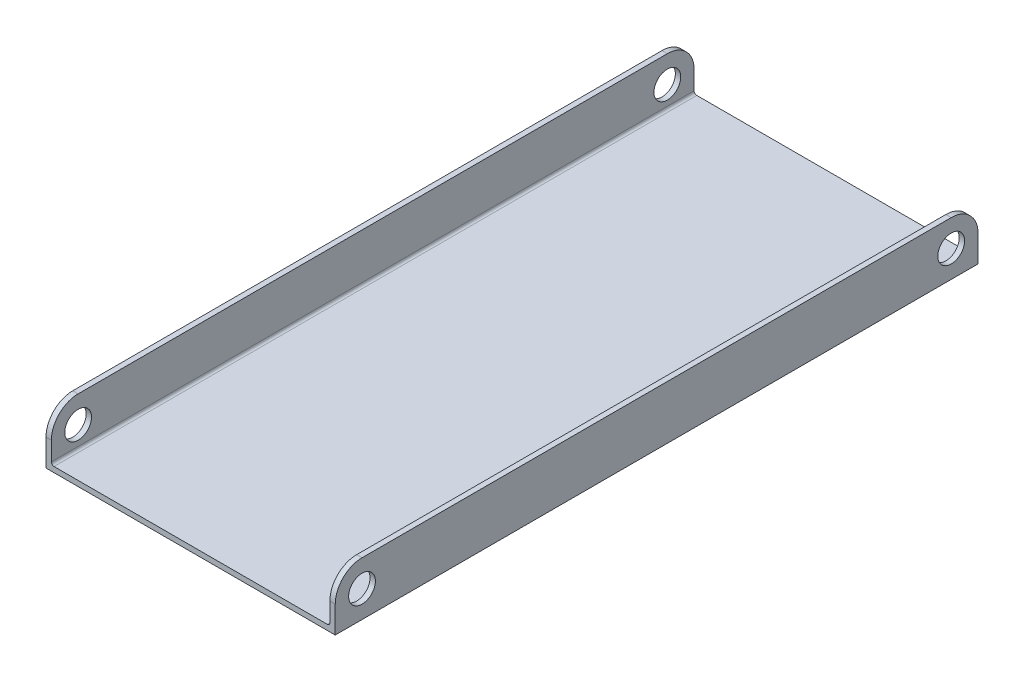
ISO-10303-21;
HEADER;
FILE_DESCRIPTION(('STEP AP214'),'2;1');
FILE_NAME('part.step','',(''),(''),'','','');
FILE_SCHEMA(('AUTOMOTIVE_DESIGN { 1 0 10303 214 1 1 1 1 }'));
ENDSEC;
DATA;
#1=APPLICATION_CONTEXT('core data for automotive mechanical design processes');
#2=APPLICATION_PROTOCOL_DEFINITION('international standard','automotive_design',2000,#1);
#3=PRODUCT_CONTEXT('',#1,'mechanical');
#4=PRODUCT('Part','Part','',(#3));
#5=PRODUCT_RELATED_PRODUCT_CATEGORY('part','',(#4));
#6=PRODUCT_DEFINITION_FORMATION('','',#4);
#7=PRODUCT_DEFINITION_CONTEXT('part definition',#1,'design');
#8=PRODUCT_DEFINITION('design','',#6,#7);
#9=PRODUCT_DEFINITION_SHAPE('','',#8);
#10=(LENGTH_UNIT() NAMED_UNIT(*) SI_UNIT(.MILLI.,.METRE.));
#11=(NAMED_UNIT(*) PLANE_ANGLE_UNIT() SI_UNIT($,.RADIAN.));
#12=(NAMED_UNIT(*) SI_UNIT($,.STERADIAN.) SOLID_ANGLE_UNIT());
#13=UNCERTAINTY_MEASURE_WITH_UNIT(LENGTH_MEASURE(1.E-05),#10,'distance_accuracy_value','');
#14=(GEOMETRIC_REPRESENTATION_CONTEXT(3) GLOBAL_UNCERTAINTY_ASSIGNED_CONTEXT((#13)) GLOBAL_UNIT_ASSIGNED_CONTEXT((#10,
#11,#12)) REPRESENTATION_CONTEXT('',''));
#15=CARTESIAN_POINT('',(0.,0.,0.));
#16=DIRECTION('',(0.,0.,1.));
#17=DIRECTION('',(1.,0.,0.));
#18=AXIS2_PLACEMENT_3D('',#15,#16,#17);
#19=CARTESIAN_POINT('',(-33.02,12.7,-152.4));
#20=DIRECTION('',(0.,1.,0.));
#21=DIRECTION('',(0.,0.,1.));
#22=AXIS2_PLACEMENT_3D('',#19,#20,#21);
#23=PLANE('',#22);
#24=DIRECTION('',(0.,0.,1.));
#25=VECTOR('',#24,1.);
#26=CARTESIAN_POINT('',(-33.02,12.7,-152.4));
#27=LINE('',#26,#25);
#28=CARTESIAN_POINT('',(-33.02,12.7,-146.05));
#29=VERTEX_POINT('',#28);
#30=CARTESIAN_POINT('',(-33.02,12.7,-6.35000000000005));
#31=VERTEX_POINT('',#30);
#32=EDGE_CURVE('E214',#29,#31,#27,.T.);
#33=ORIENTED_EDGE('',*,*,#32,.F.);
#34=DIRECTION('',(-1.,0.,0.));
#35=VECTOR('',#34,1.);
#36=CARTESIAN_POINT('',(-34.29,12.7,-146.05));
#37=LINE('',#36,#35);
#38=CARTESIAN_POINT('',(-34.29,12.7,-146.05));
#39=VERTEX_POINT('',#38);
#40=EDGE_CURVE('E278',#29,#39,#37,.T.);
#41=ORIENTED_EDGE('',*,*,#40,.T.);
#42=DIRECTION('',(0.,0.,1.));
#43=VECTOR('',#42,1.);
#44=CARTESIAN_POINT('',(-34.29,12.7,-152.4));
#45=LINE('',#44,#43);
#46=CARTESIAN_POINT('',(-34.29,12.7,-6.35000000000005));
#47=VERTEX_POINT('',#46);
#48=EDGE_CURVE('E168',#39,#47,#45,.T.);
#49=ORIENTED_EDGE('',*,*,#48,.T.);
#50=DIRECTION('',(-1.,0.,0.));
#51=VECTOR('',#50,1.);
#52=CARTESIAN_POINT('',(-33.02,12.7,-6.34999999999999));
#53=LINE('',#52,#51);
#54=EDGE_CURVE('E275',#47,#31,#53,.F.);
#55=ORIENTED_EDGE('',*,*,#54,.T.);
#56=EDGE_LOOP('',(#33,#41,#49,#55));
#57=FACE_BOUND('',#56,.T.);
#58=ADVANCED_FACE('F47',(#57),#23,.T.);
#59=CARTESIAN_POINT('',(-33.02,12.7,-152.4));
#60=DIRECTION('',(1.,0.,0.));
#61=DIRECTION('',(0.,1.,0.));
#62=AXIS2_PLACEMENT_3D('',#59,#60,#61);
#63=PLANE('',#62);
#64=CARTESIAN_POINT('',(-33.02,6.35000000000025,-6.35));
#65=DIRECTION('',(1.,0.,0.));
#66=DIRECTION('',(0.,1.,0.));
#67=AXIS2_PLACEMENT_3D('',#64,#65,#66);
#68=CIRCLE('',#67,3.175);
#69=CARTESIAN_POINT('',(-33.02,9.52500000000025,-6.35));
#70=VERTEX_POINT('',#69);
#71=EDGE_CURVE('E196',#70,#70,#68,.T.);
#72=ORIENTED_EDGE('',*,*,#71,.F.);
#73=EDGE_LOOP('',(#72));
#74=FACE_BOUND('',#73,.T.);
#75=CARTESIAN_POINT('',(-33.02,6.35000000000025,-146.05));
#76=DIRECTION('',(1.,0.,0.));
#77=DIRECTION('',(0.,1.,0.));
#78=AXIS2_PLACEMENT_3D('',#75,#76,#77);
#79=CIRCLE('',#78,3.17500000000002);
#80=CARTESIAN_POINT('',(-33.02,9.52500000000027,-146.05));
#81=VERTEX_POINT('',#80);
#82=EDGE_CURVE('E478',#81,#81,#79,.T.);
#83=ORIENTED_EDGE('',*,*,#82,.F.);
#84=EDGE_LOOP('',(#83));
#85=FACE_BOUND('',#84,.T.);
#86=DIRECTION('',(0.,1.,0.));
#87=VECTOR('',#86,1.);
#88=CARTESIAN_POINT('',(-33.02,12.7,0.));
#89=LINE('',#88,#87);
#90=CARTESIAN_POINT('',(-33.02,1.905,0.));
#91=VERTEX_POINT('',#90);
#92=CARTESIAN_POINT('',(-33.02,6.35,0.));
#93=VERTEX_POINT('',#92);
#94=EDGE_CURVE('E159',#91,#93,#89,.T.);
#95=ORIENTED_EDGE('',*,*,#94,.F.);
#96=DIRECTION('',(0.,0.,1.));
#97=VECTOR('',#96,1.);
#98=CARTESIAN_POINT('',(-33.02,1.905,-152.4));
#99=LINE('',#98,#97);
#100=CARTESIAN_POINT('',(-33.02,1.905,-152.4));
#101=VERTEX_POINT('',#100);
#102=EDGE_CURVE('E253',#91,#101,#99,.F.);
#103=ORIENTED_EDGE('',*,*,#102,.T.);
#104=DIRECTION('',(0.,1.,0.));
#105=VECTOR('',#104,1.);
#106=CARTESIAN_POINT('',(-33.02,12.7,-152.4));
#107=LINE('',#106,#105);
#108=CARTESIAN_POINT('',(-33.02,6.35,-152.4));
#109=VERTEX_POINT('',#108);
#110=EDGE_CURVE('E189',#101,#109,#107,.T.);
#111=ORIENTED_EDGE('',*,*,#110,.T.);
#112=CARTESIAN_POINT('',(-33.02,6.35,-146.05));
#113=DIRECTION('',(1.,0.,0.));
#114=DIRECTION('',(0.,1.,0.));
#115=AXIS2_PLACEMENT_3D('',#112,#113,#114);
#116=CIRCLE('',#115,6.35);
#117=EDGE_CURVE('E250',#109,#29,#116,.T.);
#118=ORIENTED_EDGE('',*,*,#117,.T.);
#119=ORIENTED_EDGE('',*,*,#32,.T.);
#120=CARTESIAN_POINT('',(-33.02,6.35,-6.35));
#121=DIRECTION('',(1.,0.,0.));
#122=DIRECTION('',(0.,1.,0.));
#123=AXIS2_PLACEMENT_3D('',#120,#121,#122);
#124=CIRCLE('',#123,6.35);
#125=EDGE_CURVE('E247',#31,#93,#124,.T.);
#126=ORIENTED_EDGE('',*,*,#125,.T.);
#127=EDGE_LOOP('',(#95,#103,#111,#118,#119,#126));
#128=FACE_BOUND('',#127,.T.);
#129=ADVANCED_FACE('F307',(#74,#85,#128),#63,.T.);
#130=CARTESIAN_POINT('',(-33.02,1.27,-152.4));
#131=DIRECTION('',(0.,1.,0.));
#132=DIRECTION('',(0.,0.,1.));
#133=AXIS2_PLACEMENT_3D('',#130,#131,#132);
#134=PLANE('',#133);
#135=DIRECTION('',(-1.,0.,0.));
#136=VECTOR('',#135,1.);
#137=CARTESIAN_POINT('',(-33.02,1.27,0.));
#138=LINE('',#137,#136);
#139=CARTESIAN_POINT('',(32.385,1.27,0.));
#140=VERTEX_POINT('',#139);
#141=CARTESIAN_POINT('',(-32.385,1.27,0.));
#142=VERTEX_POINT('',#141);
#143=EDGE_CURVE('E207',#140,#142,#138,.T.);
#144=ORIENTED_EDGE('',*,*,#143,.F.);
#145=DIRECTION('',(0.,0.,1.));
#146=VECTOR('',#145,1.);
#147=CARTESIAN_POINT('',(32.385,1.27,-152.4));
#148=LINE('',#147,#146);
#149=CARTESIAN_POINT('',(32.385,1.27,-152.4));
#150=VERTEX_POINT('',#149);
#151=EDGE_CURVE('E244',#140,#150,#148,.F.);
#152=ORIENTED_EDGE('',*,*,#151,.T.);
#153=DIRECTION('',(-1.,0.,0.));
#154=VECTOR('',#153,1.);
#155=CARTESIAN_POINT('',(-33.02,1.27,-152.4));
#156=LINE('',#155,#154);
#157=CARTESIAN_POINT('',(-32.385,1.27,-152.4));
#158=VERTEX_POINT('',#157);
#159=EDGE_CURVE('E185',#150,#158,#156,.T.);
#160=ORIENTED_EDGE('',*,*,#159,.T.);
#161=DIRECTION('',(0.,0.,1.));
#162=VECTOR('',#161,1.);
#163=CARTESIAN_POINT('',(-32.385,1.27,0.));
#164=LINE('',#163,#162);
#165=EDGE_CURVE('E240',#158,#142,#164,.T.);
#166=ORIENTED_EDGE('',*,*,#165,.T.);
#167=EDGE_LOOP('',(#144,#152,#160,#166));
#168=FACE_BOUND('',#167,.T.);
#169=ADVANCED_FACE('F315',(#168),#134,.T.);
#170=CARTESIAN_POINT('',(33.02,1.27,-152.4));
#171=DIRECTION('',(-1.,0.,0.));
#172=DIRECTION('',(0.,0.,1.));
#173=AXIS2_PLACEMENT_3D('',#170,#171,#172);
#174=PLANE('',#173);
#175=CARTESIAN_POINT('',(33.02,6.35000000000025,-6.35));
#176=DIRECTION('',(-1.,0.,0.));
#177=DIRECTION('',(0.,0.,1.));
#178=AXIS2_PLACEMENT_3D('',#175,#176,#177);
#179=CIRCLE('',#178,3.175);
#180=CARTESIAN_POINT('',(33.02,6.35000000000025,-3.175));
#181=VERTEX_POINT('',#180);
#182=EDGE_CURVE('E482',#181,#181,#179,.T.);
#183=ORIENTED_EDGE('',*,*,#182,.F.);
#184=EDGE_LOOP('',(#183));
#185=FACE_BOUND('',#184,.T.);
#186=CARTESIAN_POINT('',(33.02,6.35000000000025,-146.05));
#187=DIRECTION('',(-1.,0.,0.));
#188=DIRECTION('',(0.,0.,1.));
#189=AXIS2_PLACEMENT_3D('',#186,#187,#188);
#190=CIRCLE('',#189,3.17500000000002);
#191=CARTESIAN_POINT('',(33.02,6.35000000000025,-142.875));
#192=VERTEX_POINT('',#191);
#193=EDGE_CURVE('E474',#192,#192,#190,.T.);
#194=ORIENTED_EDGE('',*,*,#193,.F.);
#195=EDGE_LOOP('',(#194));
#196=FACE_BOUND('',#195,.T.);
#197=DIRECTION('',(0.,-1.,0.));
#198=VECTOR('',#197,1.);
#199=CARTESIAN_POINT('',(33.02,1.27,-152.4));
#200=LINE('',#199,#198);
#201=CARTESIAN_POINT('',(33.02,6.35000000000001,-152.4));
#202=VERTEX_POINT('',#201);
#203=CARTESIAN_POINT('',(33.02,1.905,-152.4));
#204=VERTEX_POINT('',#203);
#205=EDGE_CURVE('E178',#202,#204,#200,.T.);
#206=ORIENTED_EDGE('',*,*,#205,.T.);
#207=DIRECTION('',(0.,0.,1.));
#208=VECTOR('',#207,1.);
#209=CARTESIAN_POINT('',(33.02,1.905,0.));
#210=LINE('',#209,#208);
#211=CARTESIAN_POINT('',(33.02,1.905,0.));
#212=VERTEX_POINT('',#211);
#213=EDGE_CURVE('E236',#204,#212,#210,.T.);
#214=ORIENTED_EDGE('',*,*,#213,.T.);
#215=DIRECTION('',(0.,-1.,0.));
#216=VECTOR('',#215,1.);
#217=CARTESIAN_POINT('',(33.02,1.27,0.));
#218=LINE('',#217,#216);
#219=CARTESIAN_POINT('',(33.02,6.35000000000001,0.));
#220=VERTEX_POINT('',#219);
#221=EDGE_CURVE('E203',#220,#212,#218,.T.);
#222=ORIENTED_EDGE('',*,*,#221,.F.);
#223=CARTESIAN_POINT('',(33.02,6.35000000000001,-6.35));
#224=DIRECTION('',(-1.,0.,0.));
#225=DIRECTION('',(0.,0.,1.));
#226=AXIS2_PLACEMENT_3D('',#223,#224,#225);
#227=CIRCLE('',#226,6.35);
#228=CARTESIAN_POINT('',(33.02,12.7,-6.35000000000005));
#229=VERTEX_POINT('',#228);
#230=EDGE_CURVE('E218',#220,#229,#227,.T.);
#231=ORIENTED_EDGE('',*,*,#230,.T.);
#232=DIRECTION('',(0.,0.,1.));
#233=VECTOR('',#232,1.);
#234=CARTESIAN_POINT('',(33.02,12.7,-152.4));
#235=LINE('',#234,#233);
#236=CARTESIAN_POINT('',(33.02,12.7,-146.05));
#237=VERTEX_POINT('',#236);
#238=EDGE_CURVE('E219',#237,#229,#235,.T.);
#239=ORIENTED_EDGE('',*,*,#238,.F.);
#240=CARTESIAN_POINT('',(33.02,6.35000000000001,-146.05));
#241=DIRECTION('',(-1.,0.,0.));
#242=DIRECTION('',(0.,0.,1.));
#243=AXIS2_PLACEMENT_3D('',#240,#241,#242);
#244=CIRCLE('',#243,6.35);
#245=EDGE_CURVE('E233',#237,#202,#244,.T.);
#246=ORIENTED_EDGE('',*,*,#245,.T.);
#247=EDGE_LOOP('',(#206,#214,#222,#231,#239,#246));
#248=FACE_BOUND('',#247,.T.);
#249=ADVANCED_FACE('F322',(#185,#196,#248),#174,.T.);
#250=CARTESIAN_POINT('',(34.29,12.7,-152.4));
#251=DIRECTION('',(0.,1.,0.));
#252=DIRECTION('',(0.,0.,1.));
#253=AXIS2_PLACEMENT_3D('',#250,#251,#252);
#254=PLANE('',#253);
#255=DIRECTION('',(0.,0.,1.));
#256=VECTOR('',#255,1.);
#257=CARTESIAN_POINT('',(34.29,12.7,-152.4));
#258=LINE('',#257,#256);
#259=CARTESIAN_POINT('',(34.29,12.7,-146.05));
#260=VERTEX_POINT('',#259);
#261=CARTESIAN_POINT('',(34.29,12.7,-6.35000000000005));
#262=VERTEX_POINT('',#261);
#263=EDGE_CURVE('E223',#260,#262,#258,.T.);
#264=ORIENTED_EDGE('',*,*,#263,.F.);
#265=DIRECTION('',(-1.,0.,0.));
#266=VECTOR('',#265,1.);
#267=CARTESIAN_POINT('',(33.02,12.7,-146.05));
#268=LINE('',#267,#266);
#269=EDGE_CURVE('E259',#260,#237,#268,.T.);
#270=ORIENTED_EDGE('',*,*,#269,.T.);
#271=ORIENTED_EDGE('',*,*,#238,.T.);
#272=DIRECTION('',(-1.,0.,0.));
#273=VECTOR('',#272,1.);
#274=CARTESIAN_POINT('',(34.29,12.7,-6.34999999999999));
#275=LINE('',#274,#273);
#276=EDGE_CURVE('E256',#229,#262,#275,.F.);
#277=ORIENTED_EDGE('',*,*,#276,.T.);
#278=EDGE_LOOP('',(#264,#270,#271,#277));
#279=FACE_BOUND('',#278,.T.);
#280=ADVANCED_FACE('F331',(#279),#254,.T.);
#281=CARTESIAN_POINT('',(34.29,0.,-152.4));
#282=DIRECTION('',(1.,0.,0.));
#283=DIRECTION('',(0.,0.,-1.));
#284=AXIS2_PLACEMENT_3D('',#281,#282,#283);
#285=PLANE('',#284);
#286=CARTESIAN_POINT('',(34.29,6.35000000000025,-6.35));
#287=DIRECTION('',(1.,0.,0.));
#288=DIRECTION('',(0.,0.,-1.));
#289=AXIS2_PLACEMENT_3D('',#286,#287,#288);
#290=CIRCLE('',#289,3.175);
#291=CARTESIAN_POINT('',(34.29,6.35000000000025,-9.525));
#292=VERTEX_POINT('',#291);
#293=EDGE_CURVE('E470',#292,#292,#290,.T.);
#294=ORIENTED_EDGE('',*,*,#293,.F.);
#295=EDGE_LOOP('',(#294));
#296=FACE_BOUND('',#295,.T.);
#297=CARTESIAN_POINT('',(34.29,6.35000000000025,-146.05));
#298=DIRECTION('',(1.,0.,0.));
#299=DIRECTION('',(0.,0.,1.));
#300=AXIS2_PLACEMENT_3D('',#297,#298,#299);
#301=CIRCLE('',#300,3.17500000000002);
#302=CARTESIAN_POINT('',(34.29,6.35000000000025,-142.875));
#303=VERTEX_POINT('',#302);
#304=EDGE_CURVE('E466',#303,#303,#301,.T.);
#305=ORIENTED_EDGE('',*,*,#304,.F.);
#306=EDGE_LOOP('',(#305));
#307=FACE_BOUND('',#306,.T.);
#308=DIRECTION('',(0.,1.,0.));
#309=VECTOR('',#308,1.);
#310=CARTESIAN_POINT('',(34.29,0.,-152.4));
#311=LINE('',#310,#309);
#312=CARTESIAN_POINT('',(34.29,0.,-152.4));
#313=VERTEX_POINT('',#312);
#314=CARTESIAN_POINT('',(34.29,6.35000000000001,-152.4));
#315=VERTEX_POINT('',#314);
#316=EDGE_CURVE('E174',#313,#315,#311,.T.);
#317=ORIENTED_EDGE('',*,*,#316,.T.);
#318=CARTESIAN_POINT('',(34.29,6.35000000000001,-146.05));
#319=DIRECTION('',(1.,0.,0.));
#320=DIRECTION('',(0.,0.,-1.));
#321=AXIS2_PLACEMENT_3D('',#318,#319,#320);
#322=CIRCLE('',#321,6.35);
#323=EDGE_CURVE('E272',#315,#260,#322,.T.);
#324=ORIENTED_EDGE('',*,*,#323,.T.);
#325=ORIENTED_EDGE('',*,*,#263,.T.);
#326=CARTESIAN_POINT('',(34.29,6.35000000000001,-6.35));
#327=DIRECTION('',(1.,0.,0.));
#328=DIRECTION('',(0.,0.,-1.));
#329=AXIS2_PLACEMENT_3D('',#326,#327,#328);
#330=CIRCLE('',#329,6.35);
#331=CARTESIAN_POINT('',(34.29,6.35000000000001,0.));
#332=VERTEX_POINT('',#331);
#333=EDGE_CURVE('E269',#262,#332,#330,.T.);
#334=ORIENTED_EDGE('',*,*,#333,.T.);
#335=DIRECTION('',(0.,1.,0.));
#336=VECTOR('',#335,1.);
#337=CARTESIAN_POINT('',(34.29,0.,0.));
#338=LINE('',#337,#336);
#339=CARTESIAN_POINT('',(34.29,0.,0.));
#340=VERTEX_POINT('',#339);
#341=EDGE_CURVE('E199',#340,#332,#338,.T.);
#342=ORIENTED_EDGE('',*,*,#341,.F.);
#343=DIRECTION('',(0.,0.,1.));
#344=VECTOR('',#343,1.);
#345=CARTESIAN_POINT('',(34.29,0.,-152.4));
#346=LINE('',#345,#344);
#347=EDGE_CURVE('E167',#313,#340,#346,.T.);
#348=ORIENTED_EDGE('',*,*,#347,.F.);
#349=EDGE_LOOP('',(#317,#324,#325,#334,#342,#348));
#350=FACE_BOUND('',#349,.T.);
#351=ADVANCED_FACE('F335',(#296,#307,#350),#285,.T.);
#352=CARTESIAN_POINT('',(-34.29,0.,-152.4));
#353=DIRECTION('',(0.,-1.,0.));
#354=DIRECTION('',(1.,0.,0.));
#355=AXIS2_PLACEMENT_3D('',#352,#353,#354);
#356=PLANE('',#355);
#357=DIRECTION('',(1.,0.,0.));
#358=VECTOR('',#357,1.);
#359=CARTESIAN_POINT('',(-34.29,0.,0.));
#360=LINE('',#359,#358);
#361=CARTESIAN_POINT('',(-34.29,0.,0.));
#362=VERTEX_POINT('',#361);
#363=EDGE_CURVE('E165',#362,#340,#360,.T.);
#364=ORIENTED_EDGE('',*,*,#363,.F.);
#365=DIRECTION('',(0.,0.,1.));
#366=VECTOR('',#365,1.);
#367=CARTESIAN_POINT('',(-34.29,0.,-152.4));
#368=LINE('',#367,#366);
#369=CARTESIAN_POINT('',(-34.29,0.,-152.4));
#370=VERTEX_POINT('',#369);
#371=EDGE_CURVE('E151',#370,#362,#368,.T.);
#372=ORIENTED_EDGE('',*,*,#371,.F.);
#373=DIRECTION('',(1.,0.,0.));
#374=VECTOR('',#373,1.);
#375=CARTESIAN_POINT('',(-34.29,0.,-152.4));
#376=LINE('',#375,#374);
#377=EDGE_CURVE('E158',#370,#313,#376,.T.);
#378=ORIENTED_EDGE('',*,*,#377,.T.);
#379=ORIENTED_EDGE('',*,*,#347,.T.);
#380=EDGE_LOOP('',(#364,#372,#378,#379));
#381=FACE_BOUND('',#380,.T.);
#382=ADVANCED_FACE('F163',(#381),#356,.T.);
#383=CARTESIAN_POINT('',(-34.29,12.7,-152.4));
#384=DIRECTION('',(-1.,0.,0.));
#385=DIRECTION('',(0.,0.,1.));
#386=AXIS2_PLACEMENT_3D('',#383,#384,#385);
#387=PLANE('',#386);
#388=CARTESIAN_POINT('',(-34.29,6.35000000000025,-6.35));
#389=DIRECTION('',(1.,0.,0.));
#390=DIRECTION('',(0.,0.,-1.));
#391=AXIS2_PLACEMENT_3D('',#388,#389,#390);
#392=CIRCLE('',#391,3.175);
#393=CARTESIAN_POINT('',(-34.29,6.35000000000025,-9.525));
#394=VERTEX_POINT('',#393);
#395=EDGE_CURVE('E460',#394,#394,#392,.T.);
#396=ORIENTED_EDGE('',*,*,#395,.T.);
#397=EDGE_LOOP('',(#396));
#398=FACE_BOUND('',#397,.T.);
#399=CARTESIAN_POINT('',(-34.29,6.35000000000025,-146.05));
#400=DIRECTION('',(1.,0.,0.));
#401=DIRECTION('',(0.,0.,1.));
#402=AXIS2_PLACEMENT_3D('',#399,#400,#401);
#403=CIRCLE('',#402,3.17500000000002);
#404=CARTESIAN_POINT('',(-34.29,6.35000000000025,-142.875));
#405=VERTEX_POINT('',#404);
#406=EDGE_CURVE('E463',#405,#405,#403,.T.);
#407=ORIENTED_EDGE('',*,*,#406,.T.);
#408=EDGE_LOOP('',(#407));
#409=FACE_BOUND('',#408,.T.);
#410=ORIENTED_EDGE('',*,*,#48,.F.);
#411=CARTESIAN_POINT('',(-34.29,6.35,-146.05));
#412=DIRECTION('',(-1.,0.,0.));
#413=DIRECTION('',(0.,0.,1.));
#414=AXIS2_PLACEMENT_3D('',#411,#412,#413);
#415=CIRCLE('',#414,6.35);
#416=CARTESIAN_POINT('',(-34.29,6.35,-152.4));
#417=VERTEX_POINT('',#416);
#418=EDGE_CURVE('E153',#39,#417,#415,.T.);
#419=ORIENTED_EDGE('',*,*,#418,.T.);
#420=DIRECTION('',(0.,-1.,0.));
#421=VECTOR('',#420,1.);
#422=CARTESIAN_POINT('',(-34.29,12.7,-152.4));
#423=LINE('',#422,#421);
#424=EDGE_CURVE('E148',#417,#370,#423,.T.);
#425=ORIENTED_EDGE('',*,*,#424,.T.);
#426=ORIENTED_EDGE('',*,*,#371,.T.);
#427=DIRECTION('',(0.,-1.,0.));
#428=VECTOR('',#427,1.);
#429=CARTESIAN_POINT('',(-34.29,12.7,0.));
#430=LINE('',#429,#428);
#431=CARTESIAN_POINT('',(-34.29,6.35,0.));
#432=VERTEX_POINT('',#431);
#433=EDGE_CURVE('E193',#432,#362,#430,.T.);
#434=ORIENTED_EDGE('',*,*,#433,.F.);
#435=CARTESIAN_POINT('',(-34.29,6.35,-6.35));
#436=DIRECTION('',(-1.,0.,0.));
#437=DIRECTION('',(0.,0.,1.));
#438=AXIS2_PLACEMENT_3D('',#435,#436,#437);
#439=CIRCLE('',#438,6.35);
#440=EDGE_CURVE('E63',#432,#47,#439,.T.);
#441=ORIENTED_EDGE('',*,*,#440,.T.);
#442=EDGE_LOOP('',(#410,#419,#425,#426,#434,#441));
#443=FACE_BOUND('',#442,.T.);
#444=ADVANCED_FACE('F150',(#398,#409,#443),#387,.T.);
#445=CARTESIAN_POINT('',(0.,0.,-152.4));
#446=DIRECTION('',(0.,0.,1.));
#447=DIRECTION('',(1.,0.,0.));
#448=AXIS2_PLACEMENT_3D('',#445,#446,#447);
#449=PLANE('',#448);
#450=ORIENTED_EDGE('',*,*,#205,.F.);
#451=DIRECTION('',(-1.,0.,0.));
#452=VECTOR('',#451,1.);
#453=CARTESIAN_POINT('',(34.29,6.35000000000001,-152.4));
#454=LINE('',#453,#452);
#455=EDGE_CURVE('E266',#202,#315,#454,.F.);
#456=ORIENTED_EDGE('',*,*,#455,.T.);
#457=ORIENTED_EDGE('',*,*,#316,.F.);
#458=ORIENTED_EDGE('',*,*,#377,.F.);
#459=ORIENTED_EDGE('',*,*,#424,.F.);
#460=DIRECTION('',(-1.,0.,0.));
#461=VECTOR('',#460,1.);
#462=CARTESIAN_POINT('',(-33.02,6.35,-152.4));
#463=LINE('',#462,#461);
#464=EDGE_CURVE('E263',#417,#109,#463,.F.);
#465=ORIENTED_EDGE('',*,*,#464,.T.);
#466=ORIENTED_EDGE('',*,*,#110,.F.);
#467=CARTESIAN_POINT('',(-32.385,1.905,-152.4));
#468=DIRECTION('',(0.,0.,1.));
#469=DIRECTION('',(1.,0.,0.));
#470=AXIS2_PLACEMENT_3D('',#467,#468,#469);
#471=CIRCLE('',#470,0.635);
#472=EDGE_CURVE('E12',#101,#158,#471,.T.);
#473=ORIENTED_EDGE('',*,*,#472,.T.);
#474=ORIENTED_EDGE('',*,*,#159,.F.);
#475=CARTESIAN_POINT('',(32.385,1.905,-152.4));
#476=DIRECTION('',(0.,0.,1.));
#477=DIRECTION('',(1.,0.,0.));
#478=AXIS2_PLACEMENT_3D('',#475,#476,#477);
#479=CIRCLE('',#478,0.635);
#480=EDGE_CURVE('E296',#150,#204,#479,.T.);
#481=ORIENTED_EDGE('',*,*,#480,.T.);
#482=EDGE_LOOP('',(#450,#456,#457,#458,#459,#465,#466,#473,#474,#481));
#483=FACE_BOUND('',#482,.T.);
#484=ADVANCED_FACE('F172',(#483),#449,.F.);
#485=CARTESIAN_POINT('',(0.,0.,0.));
#486=DIRECTION('',(0.,0.,1.));
#487=DIRECTION('',(1.,0.,0.));
#488=AXIS2_PLACEMENT_3D('',#485,#486,#487);
#489=PLANE('',#488);
#490=ORIENTED_EDGE('',*,*,#94,.T.);
#491=DIRECTION('',(-1.,0.,0.));
#492=VECTOR('',#491,1.);
#493=CARTESIAN_POINT('',(0.,6.35,0.));
#494=LINE('',#493,#492);
#495=EDGE_CURVE('E290',#93,#432,#494,.T.);
#496=ORIENTED_EDGE('',*,*,#495,.T.);
#497=ORIENTED_EDGE('',*,*,#433,.T.);
#498=ORIENTED_EDGE('',*,*,#363,.T.);
#499=ORIENTED_EDGE('',*,*,#341,.T.);
#500=DIRECTION('',(-1.,0.,0.));
#501=VECTOR('',#500,1.);
#502=CARTESIAN_POINT('',(0.,6.35000000000001,0.));
#503=LINE('',#502,#501);
#504=EDGE_CURVE('E286',#332,#220,#503,.T.);
#505=ORIENTED_EDGE('',*,*,#504,.T.);
#506=ORIENTED_EDGE('',*,*,#221,.T.);
#507=CARTESIAN_POINT('',(32.385,1.905,0.));
#508=DIRECTION('',(0.,0.,1.));
#509=DIRECTION('',(1.,0.,0.));
#510=AXIS2_PLACEMENT_3D('',#507,#508,#509);
#511=CIRCLE('',#510,0.635);
#512=EDGE_CURVE('E293',#212,#140,#511,.F.);
#513=ORIENTED_EDGE('',*,*,#512,.T.);
#514=ORIENTED_EDGE('',*,*,#143,.T.);
#515=CARTESIAN_POINT('',(-32.385,1.905,0.));
#516=DIRECTION('',(0.,0.,1.));
#517=DIRECTION('',(1.,0.,0.));
#518=AXIS2_PLACEMENT_3D('',#515,#516,#517);
#519=CIRCLE('',#518,0.635);
#520=EDGE_CURVE('E56',#142,#91,#519,.F.);
#521=ORIENTED_EDGE('',*,*,#520,.T.);
#522=EDGE_LOOP('',(#490,#496,#497,#498,#499,#505,#506,#513,#514,#521));
#523=FACE_BOUND('',#522,.T.);
#524=ADVANCED_FACE('F301',(#523),#489,.T.);
#525=CARTESIAN_POINT('',(32.385,1.905,-152.4));
#526=DIRECTION('',(0.,0.,-1.));
#527=DIRECTION('',(-1.,0.,0.));
#528=AXIS2_PLACEMENT_3D('',#525,#526,#527);
#529=CYLINDRICAL_SURFACE('',#528,0.635);
#530=ORIENTED_EDGE('',*,*,#480,.F.);
#531=ORIENTED_EDGE('',*,*,#151,.F.);
#532=ORIENTED_EDGE('',*,*,#512,.F.);
#533=ORIENTED_EDGE('',*,*,#213,.F.);
#534=EDGE_LOOP('',(#530,#531,#532,#533));
#535=FACE_BOUND('',#534,.T.);
#536=ADVANCED_FACE('F318',(#535),#529,.F.);
#537=CARTESIAN_POINT('',(-32.385,1.905,-152.4));
#538=DIRECTION('',(0.,0.,-1.));
#539=DIRECTION('',(-1.,0.,0.));
#540=AXIS2_PLACEMENT_3D('',#537,#538,#539);
#541=CYLINDRICAL_SURFACE('',#540,0.635);
#542=ORIENTED_EDGE('',*,*,#472,.F.);
#543=ORIENTED_EDGE('',*,*,#102,.F.);
#544=ORIENTED_EDGE('',*,*,#520,.F.);
#545=ORIENTED_EDGE('',*,*,#165,.F.);
#546=EDGE_LOOP('',(#542,#543,#544,#545));
#547=FACE_BOUND('',#546,.T.);
#548=ADVANCED_FACE('F311',(#547),#541,.F.);
#549=CARTESIAN_POINT('',(34.29,6.35000000000001,-146.05));
#550=DIRECTION('',(1.,0.,0.));
#551=DIRECTION('',(0.,0.,-1.));
#552=AXIS2_PLACEMENT_3D('',#549,#550,#551);
#553=CYLINDRICAL_SURFACE('',#552,6.35);
#554=ORIENTED_EDGE('',*,*,#323,.F.);
#555=ORIENTED_EDGE('',*,*,#455,.F.);
#556=ORIENTED_EDGE('',*,*,#245,.F.);
#557=ORIENTED_EDGE('',*,*,#269,.F.);
#558=EDGE_LOOP('',(#554,#555,#556,#557));
#559=FACE_BOUND('',#558,.T.);
#560=ADVANCED_FACE('F328',(#559),#553,.T.);
#561=CARTESIAN_POINT('',(-33.02,6.35,-146.05));
#562=DIRECTION('',(1.,0.,0.));
#563=DIRECTION('',(0.,0.,-1.));
#564=AXIS2_PLACEMENT_3D('',#561,#562,#563);
#565=CYLINDRICAL_SURFACE('',#564,6.35);
#566=ORIENTED_EDGE('',*,*,#117,.F.);
#567=ORIENTED_EDGE('',*,*,#464,.F.);
#568=ORIENTED_EDGE('',*,*,#418,.F.);
#569=ORIENTED_EDGE('',*,*,#40,.F.);
#570=EDGE_LOOP('',(#566,#567,#568,#569));
#571=FACE_BOUND('',#570,.T.);
#572=ADVANCED_FACE('F345',(#571),#565,.T.);
#573=CARTESIAN_POINT('',(0.,6.35,-6.35));
#574=DIRECTION('',(-1.,0.,0.));
#575=DIRECTION('',(0.,0.,1.));
#576=AXIS2_PLACEMENT_3D('',#573,#574,#575);
#577=CYLINDRICAL_SURFACE('',#576,6.35);
#578=ORIENTED_EDGE('',*,*,#125,.F.);
#579=ORIENTED_EDGE('',*,*,#54,.F.);
#580=ORIENTED_EDGE('',*,*,#440,.F.);
#581=ORIENTED_EDGE('',*,*,#495,.F.);
#582=EDGE_LOOP('',(#578,#579,#580,#581));
#583=FACE_BOUND('',#582,.T.);
#584=ADVANCED_FACE('F339',(#583),#577,.T.);
#585=CARTESIAN_POINT('',(0.,6.35000000000001,-6.35));
#586=DIRECTION('',(-1.,0.,0.));
#587=DIRECTION('',(0.,0.,1.));
#588=AXIS2_PLACEMENT_3D('',#585,#586,#587);
#589=CYLINDRICAL_SURFACE('',#588,6.35);
#590=ORIENTED_EDGE('',*,*,#333,.F.);
#591=ORIENTED_EDGE('',*,*,#276,.F.);
#592=ORIENTED_EDGE('',*,*,#230,.F.);
#593=ORIENTED_EDGE('',*,*,#504,.F.);
#594=EDGE_LOOP('',(#590,#591,#592,#593));
#595=FACE_BOUND('',#594,.T.);
#596=ADVANCED_FACE('F49',(#595),#589,.T.);
#597=CARTESIAN_POINT('',(-34.29,6.35000000000025,-146.05));
#598=DIRECTION('',(1.,0.,0.));
#599=DIRECTION('',(0.,0.,-1.));
#600=AXIS2_PLACEMENT_3D('',#597,#598,#599);
#601=CYLINDRICAL_SURFACE('',#600,3.17500000000002);
#602=ORIENTED_EDGE('',*,*,#82,.T.);
#603=EDGE_LOOP('',(#602));
#604=FACE_BOUND('',#603,.T.);
#605=ORIENTED_EDGE('',*,*,#406,.F.);
#606=EDGE_LOOP('',(#605));
#607=FACE_BOUND('',#606,.T.);
#608=ADVANCED_FACE('F398',(#604,#607),#601,.F.);
#609=CARTESIAN_POINT('',(-34.29,6.35000000000025,-6.35));
#610=DIRECTION('',(1.,0.,0.));
#611=DIRECTION('',(0.,0.,-1.));
#612=AXIS2_PLACEMENT_3D('',#609,#610,#611);
#613=CYLINDRICAL_SURFACE('',#612,3.175);
#614=ORIENTED_EDGE('',*,*,#71,.T.);
#615=EDGE_LOOP('',(#614));
#616=FACE_BOUND('',#615,.T.);
#617=ORIENTED_EDGE('',*,*,#395,.F.);
#618=EDGE_LOOP('',(#617));
#619=FACE_BOUND('',#618,.T.);
#620=ADVANCED_FACE('F406',(#616,#619),#613,.F.);
#621=ORIENTED_EDGE('',*,*,#193,.T.);
#622=EDGE_LOOP('',(#621));
#623=FACE_BOUND('',#622,.T.);
#624=ORIENTED_EDGE('',*,*,#304,.T.);
#625=EDGE_LOOP('',(#624));
#626=FACE_BOUND('',#625,.T.);
#627=ADVANCED_FACE('F409',(#623,#626),#601,.F.);
#628=ORIENTED_EDGE('',*,*,#182,.T.);
#629=EDGE_LOOP('',(#628));
#630=FACE_BOUND('',#629,.T.);
#631=ORIENTED_EDGE('',*,*,#293,.T.);
#632=EDGE_LOOP('',(#631));
#633=FACE_BOUND('',#632,.T.);
#634=ADVANCED_FACE('F420',(#630,#633),#613,.F.);
#635=CLOSED_SHELL('',(#58,#129,#169,#249,#280,#351,#382,#444,#484,#524,#536,#548,#560,#572,#584,
#596,#608,#620,#627,#634));
#636=MANIFOLD_SOLID_BREP('B2',#635);
#637=ADVANCED_BREP_SHAPE_REPRESENTATION('',(#18,#636),#14);
#638=SHAPE_DEFINITION_REPRESENTATION(#9,#637);
ENDSEC;
END-ISO-10303-21;
